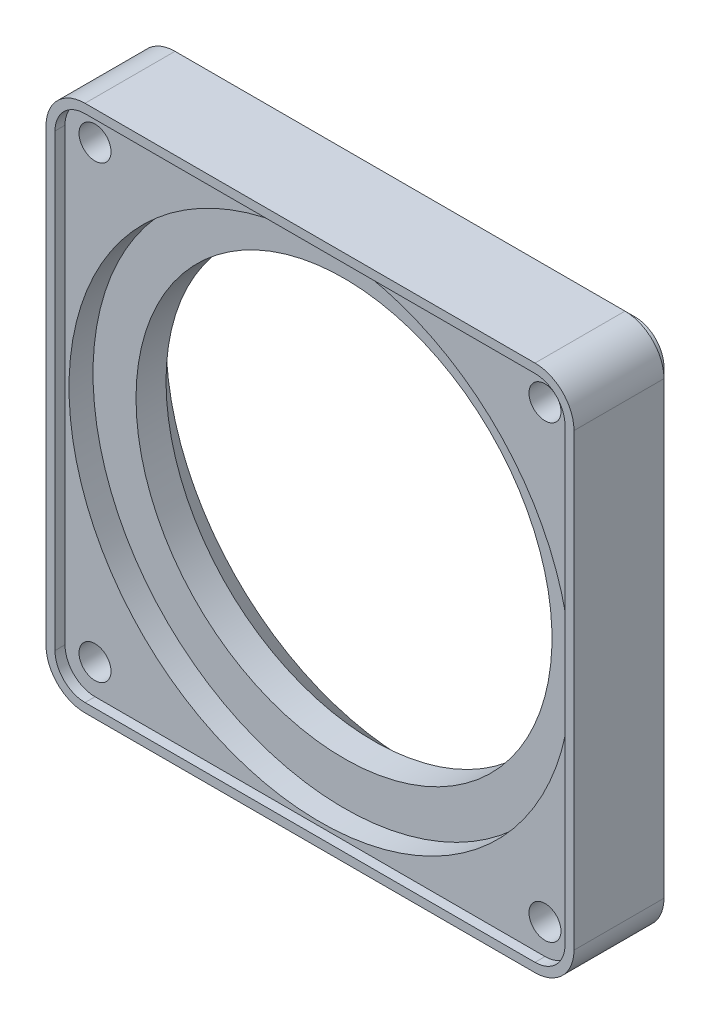
ISO-10303-21;
HEADER;
FILE_DESCRIPTION(('STEP AP214'),'2;1');
FILE_NAME('part.step','',(''),(''),'','','');
FILE_SCHEMA(('AUTOMOTIVE_DESIGN { 1 0 10303 214 1 1 1 1 }'));
ENDSEC;
DATA;
#1=APPLICATION_CONTEXT('core data for automotive mechanical design processes');
#2=APPLICATION_PROTOCOL_DEFINITION('international standard','automotive_design',2000,#1);
#3=PRODUCT_CONTEXT('',#1,'mechanical');
#4=PRODUCT('Part','Part','',(#3));
#5=PRODUCT_RELATED_PRODUCT_CATEGORY('part','',(#4));
#6=PRODUCT_DEFINITION_FORMATION('','',#4);
#7=PRODUCT_DEFINITION_CONTEXT('part definition',#1,'design');
#8=PRODUCT_DEFINITION('design','',#6,#7);
#9=PRODUCT_DEFINITION_SHAPE('','',#8);
#10=(LENGTH_UNIT() NAMED_UNIT(*) SI_UNIT(.MILLI.,.METRE.));
#11=(NAMED_UNIT(*) PLANE_ANGLE_UNIT() SI_UNIT($,.RADIAN.));
#12=(NAMED_UNIT(*) SI_UNIT($,.STERADIAN.) SOLID_ANGLE_UNIT());
#13=UNCERTAINTY_MEASURE_WITH_UNIT(LENGTH_MEASURE(1.E-05),#10,'distance_accuracy_value','');
#14=(GEOMETRIC_REPRESENTATION_CONTEXT(3) GLOBAL_UNCERTAINTY_ASSIGNED_CONTEXT((#13)) GLOBAL_UNIT_ASSIGNED_CONTEXT((#10,
#11,#12)) REPRESENTATION_CONTEXT('',''));
#15=CARTESIAN_POINT('',(0.,0.,0.));
#16=DIRECTION('',(0.,0.,1.));
#17=DIRECTION('',(1.,0.,0.));
#18=AXIS2_PLACEMENT_3D('',#15,#16,#17);
#19=CARTESIAN_POINT('',(-13.2,-13.2,-6.46999999999999));
#20=DIRECTION('',(0.,0.,1.));
#21=DIRECTION('',(1.,0.,0.));
#22=AXIS2_PLACEMENT_3D('',#19,#20,#21);
#23=PLANE('',#22);
#24=CARTESIAN_POINT('',(11.25,-11.25,-6.46999999999999));
#25=DIRECTION('',(0.,0.,1.));
#26=DIRECTION('',(1.,0.,0.));
#27=AXIS2_PLACEMENT_3D('',#24,#25,#26);
#28=CIRCLE('',#27,1.5);
#29=CARTESIAN_POINT('',(12.75,-11.25,-6.46999999999999));
#30=VERTEX_POINT('',#29);
#31=CARTESIAN_POINT('',(11.25,-12.75,-6.46999999999999));
#32=VERTEX_POINT('',#31);
#33=EDGE_CURVE('E210',#30,#32,#28,.F.);
#34=ORIENTED_EDGE('',*,*,#33,.T.);
#35=DIRECTION('',(1.,0.,0.));
#36=VECTOR('',#35,1.);
#37=CARTESIAN_POINT('',(11.25,-12.75,-6.46999999999999));
#38=LINE('',#37,#36);
#39=CARTESIAN_POINT('',(-11.25,-12.75,-6.46999999999999));
#40=VERTEX_POINT('',#39);
#41=EDGE_CURVE('E207',#40,#32,#38,.T.);
#42=ORIENTED_EDGE('',*,*,#41,.F.);
#43=CARTESIAN_POINT('',(-11.25,-11.25,-6.46999999999999));
#44=DIRECTION('',(0.,0.,1.));
#45=DIRECTION('',(1.,0.,0.));
#46=AXIS2_PLACEMENT_3D('',#43,#44,#45);
#47=CIRCLE('',#46,1.5);
#48=CARTESIAN_POINT('',(-12.75,-11.25,-6.46999999999999));
#49=VERTEX_POINT('',#48);
#50=EDGE_CURVE('E197',#40,#49,#47,.F.);
#51=ORIENTED_EDGE('',*,*,#50,.T.);
#52=DIRECTION('',(0.,1.,0.));
#53=VECTOR('',#52,1.);
#54=CARTESIAN_POINT('',(-12.75,-11.25,-6.46999999999999));
#55=LINE('',#54,#53);
#56=CARTESIAN_POINT('',(-12.75,11.25,-6.46999999999999));
#57=VERTEX_POINT('',#56);
#58=EDGE_CURVE('E187',#57,#49,#55,.F.);
#59=ORIENTED_EDGE('',*,*,#58,.F.);
#60=CARTESIAN_POINT('',(-11.25,11.25,-6.46999999999999));
#61=DIRECTION('',(0.,0.,1.));
#62=DIRECTION('',(1.,0.,0.));
#63=AXIS2_PLACEMENT_3D('',#60,#61,#62);
#64=CIRCLE('',#63,1.5);
#65=CARTESIAN_POINT('',(-11.25,12.75,-6.46999999999999));
#66=VERTEX_POINT('',#65);
#67=EDGE_CURVE('E20',#57,#66,#64,.F.);
#68=ORIENTED_EDGE('',*,*,#67,.T.);
#69=DIRECTION('',(1.,0.,0.));
#70=VECTOR('',#69,1.);
#71=CARTESIAN_POINT('',(-11.25,12.75,-6.46999999999999));
#72=LINE('',#71,#70);
#73=CARTESIAN_POINT('',(11.25,12.75,-6.46999999999999));
#74=VERTEX_POINT('',#73);
#75=EDGE_CURVE('E184',#74,#66,#72,.F.);
#76=ORIENTED_EDGE('',*,*,#75,.F.);
#77=CARTESIAN_POINT('',(11.25,11.25,-6.46999999999999));
#78=DIRECTION('',(0.,0.,1.));
#79=DIRECTION('',(1.,0.,0.));
#80=AXIS2_PLACEMENT_3D('',#77,#78,#79);
#81=CIRCLE('',#80,1.5);
#82=CARTESIAN_POINT('',(12.75,11.25,-6.46999999999999));
#83=VERTEX_POINT('',#82);
#84=EDGE_CURVE('E214',#74,#83,#81,.F.);
#85=ORIENTED_EDGE('',*,*,#84,.T.);
#86=DIRECTION('',(0.,1.,0.));
#87=VECTOR('',#86,1.);
#88=CARTESIAN_POINT('',(12.75,11.25,-6.46999999999999));
#89=LINE('',#88,#87);
#90=EDGE_CURVE('E211',#30,#83,#89,.T.);
#91=ORIENTED_EDGE('',*,*,#90,.F.);
#92=EDGE_LOOP('',(#34,#42,#51,#59,#68,#76,#85,#91));
#93=FACE_BOUND('',#92,.T.);
#94=DIRECTION('',(1.,0.,0.));
#95=VECTOR('',#94,1.);
#96=CARTESIAN_POINT('',(13.2,13.2,-6.46999999999999));
#97=LINE('',#96,#95);
#98=CARTESIAN_POINT('',(11.25,13.2,-6.46999999999999));
#99=VERTEX_POINT('',#98);
#100=CARTESIAN_POINT('',(-11.25,13.2,-6.46999999999999));
#101=VERTEX_POINT('',#100);
#102=EDGE_CURVE('E205',#99,#101,#97,.F.);
#103=ORIENTED_EDGE('',*,*,#102,.T.);
#104=CARTESIAN_POINT('',(-11.25,11.25,-6.46999999999999));
#105=DIRECTION('',(0.,0.,-1.));
#106=DIRECTION('',(-1.,0.,0.));
#107=AXIS2_PLACEMENT_3D('',#104,#105,#106);
#108=CIRCLE('',#107,1.95);
#109=CARTESIAN_POINT('',(-13.2,11.25,-6.46999999999999));
#110=VERTEX_POINT('',#109);
#111=EDGE_CURVE('E319',#110,#101,#108,.T.);
#112=ORIENTED_EDGE('',*,*,#111,.F.);
#113=DIRECTION('',(0.,1.,0.));
#114=VECTOR('',#113,1.);
#115=CARTESIAN_POINT('',(-13.2,13.2,-6.46999999999999));
#116=LINE('',#115,#114);
#117=CARTESIAN_POINT('',(-13.2,-11.25,-6.46999999999999));
#118=VERTEX_POINT('',#117);
#119=EDGE_CURVE('E347',#110,#118,#116,.F.);
#120=ORIENTED_EDGE('',*,*,#119,.T.);
#121=CARTESIAN_POINT('',(-11.25,-11.25,-6.46999999999999));
#122=DIRECTION('',(0.,0.,-1.));
#123=DIRECTION('',(-1.,0.,0.));
#124=AXIS2_PLACEMENT_3D('',#121,#122,#123);
#125=CIRCLE('',#124,1.95);
#126=CARTESIAN_POINT('',(-11.25,-13.2,-6.46999999999999));
#127=VERTEX_POINT('',#126);
#128=EDGE_CURVE('E315',#127,#118,#125,.T.);
#129=ORIENTED_EDGE('',*,*,#128,.F.);
#130=DIRECTION('',(1.,0.,0.));
#131=VECTOR('',#130,1.);
#132=CARTESIAN_POINT('',(-13.2,-13.2,-6.46999999999999));
#133=LINE('',#132,#131);
#134=CARTESIAN_POINT('',(11.25,-13.2,-6.46999999999999));
#135=VERTEX_POINT('',#134);
#136=EDGE_CURVE('E342',#127,#135,#133,.T.);
#137=ORIENTED_EDGE('',*,*,#136,.T.);
#138=CARTESIAN_POINT('',(11.25,-11.25,-6.46999999999999));
#139=DIRECTION('',(0.,0.,-1.));
#140=DIRECTION('',(-1.,0.,0.));
#141=AXIS2_PLACEMENT_3D('',#138,#139,#140);
#142=CIRCLE('',#141,1.95);
#143=CARTESIAN_POINT('',(13.2,-11.25,-6.46999999999999));
#144=VERTEX_POINT('',#143);
#145=EDGE_CURVE('E312',#144,#135,#142,.T.);
#146=ORIENTED_EDGE('',*,*,#145,.F.);
#147=DIRECTION('',(0.,1.,0.));
#148=VECTOR('',#147,1.);
#149=CARTESIAN_POINT('',(13.2,-13.2,-6.46999999999999));
#150=LINE('',#149,#148);
#151=CARTESIAN_POINT('',(13.2,11.25,-6.46999999999999));
#152=VERTEX_POINT('',#151);
#153=EDGE_CURVE('E326',#144,#152,#150,.T.);
#154=ORIENTED_EDGE('',*,*,#153,.T.);
#155=CARTESIAN_POINT('',(11.25,11.25,-6.46999999999999));
#156=DIRECTION('',(0.,0.,-1.));
#157=DIRECTION('',(-1.,0.,0.));
#158=AXIS2_PLACEMENT_3D('',#155,#156,#157);
#159=CIRCLE('',#158,1.95);
#160=EDGE_CURVE('E323',#99,#152,#159,.T.);
#161=ORIENTED_EDGE('',*,*,#160,.F.);
#162=EDGE_LOOP('',(#103,#112,#120,#129,#137,#146,#154,#161));
#163=FACE_BOUND('',#162,.T.);
#164=ADVANCED_FACE('F17',(#93,#163),#23,.T.);
#165=CARTESIAN_POINT('',(0.,0.,-8.16999999999999));
#166=DIRECTION('',(0.,0.,1.));
#167=DIRECTION('',(1.,0.,0.));
#168=AXIS2_PLACEMENT_3D('',#165,#166,#167);
#169=PLANE('',#168);
#170=CARTESIAN_POINT('',(0.,0.,-8.16999999999999));
#171=DIRECTION('',(0.,0.,-1.));
#172=DIRECTION('',(-1.,0.,0.));
#173=AXIS2_PLACEMENT_3D('',#170,#171,#172);
#174=CIRCLE('',#173,10.4);
#175=CARTESIAN_POINT('',(-10.4,0.,-8.16999999999999));
#176=VERTEX_POINT('',#175);
#177=EDGE_CURVE('E308',#176,#176,#174,.T.);
#178=ORIENTED_EDGE('',*,*,#177,.T.);
#179=EDGE_LOOP('',(#178));
#180=FACE_BOUND('',#179,.T.);
#181=CARTESIAN_POINT('',(0.,0.,-8.16999999999999));
#182=DIRECTION('',(0.,0.,1.));
#183=DIRECTION('',(1.,0.,0.));
#184=AXIS2_PLACEMENT_3D('',#181,#182,#183);
#185=CIRCLE('',#184,12.55);
#186=CARTESIAN_POINT('',(12.55,0.,-8.16999999999999));
#187=VERTEX_POINT('',#186);
#188=EDGE_CURVE('E191',#187,#187,#185,.T.);
#189=ORIENTED_EDGE('',*,*,#188,.T.);
#190=EDGE_LOOP('',(#189));
#191=FACE_BOUND('',#190,.T.);
#192=ADVANCED_FACE('F588',(#180,#191),#169,.T.);
#193=CARTESIAN_POINT('',(-11.25,11.25,-6.96999999999999));
#194=DIRECTION('',(0.,0.,1.));
#195=DIRECTION('',(1.,0.,0.));
#196=AXIS2_PLACEMENT_3D('',#193,#194,#195);
#197=CYLINDRICAL_SURFACE('',#196,1.5);
#198=DIRECTION('',(0.,0.,1.));
#199=VECTOR('',#198,1.);
#200=CARTESIAN_POINT('',(-12.75,11.25,-6.96999999999999));
#201=LINE('',#200,#199);
#202=CARTESIAN_POINT('',(-12.75,11.25,-6.96999999999999));
#203=VERTEX_POINT('',#202);
#204=EDGE_CURVE('E179',#203,#57,#201,.T.);
#205=ORIENTED_EDGE('',*,*,#204,.F.);
#206=CARTESIAN_POINT('',(-11.25,11.25,-6.96999999999999));
#207=DIRECTION('',(0.,0.,1.));
#208=DIRECTION('',(1.,0.,0.));
#209=AXIS2_PLACEMENT_3D('',#206,#207,#208);
#210=CIRCLE('',#209,1.5);
#211=CARTESIAN_POINT('',(-11.25,12.75,-6.96999999999999));
#212=VERTEX_POINT('',#211);
#213=EDGE_CURVE('E306',#203,#212,#210,.F.);
#214=ORIENTED_EDGE('',*,*,#213,.T.);
#215=DIRECTION('',(0.,0.,1.));
#216=VECTOR('',#215,1.);
#217=CARTESIAN_POINT('',(-11.25,12.75,-6.96999999999999));
#218=LINE('',#217,#216);
#219=EDGE_CURVE('E181',#66,#212,#218,.F.);
#220=ORIENTED_EDGE('',*,*,#219,.F.);
#221=ORIENTED_EDGE('',*,*,#67,.F.);
#222=EDGE_LOOP('',(#205,#214,#220,#221));
#223=FACE_BOUND('',#222,.T.);
#224=ADVANCED_FACE('F177',(#223),#197,.F.);
#225=CARTESIAN_POINT('',(-11.25,12.75,-6.96999999999999));
#226=DIRECTION('',(0.,-1.,0.));
#227=DIRECTION('',(1.,0.,0.));
#228=AXIS2_PLACEMENT_3D('',#225,#226,#227);
#229=PLANE('',#228);
#230=DIRECTION('',(-1.,0.,0.));
#231=VECTOR('',#230,1.);
#232=CARTESIAN_POINT('',(-11.25,12.75,-6.96999999999999));
#233=LINE('',#232,#231);
#234=CARTESIAN_POINT('',(11.25,12.75,-6.96999999999999));
#235=VERTEX_POINT('',#234);
#236=EDGE_CURVE('E305',#212,#235,#233,.F.);
#237=ORIENTED_EDGE('',*,*,#236,.T.);
#238=DIRECTION('',(0.,0.,1.));
#239=VECTOR('',#238,1.);
#240=CARTESIAN_POINT('',(11.25,12.75,-6.96999999999999));
#241=LINE('',#240,#239);
#242=EDGE_CURVE('E331',#235,#74,#241,.T.);
#243=ORIENTED_EDGE('',*,*,#242,.T.);
#244=ORIENTED_EDGE('',*,*,#75,.T.);
#245=ORIENTED_EDGE('',*,*,#219,.T.);
#246=EDGE_LOOP('',(#237,#243,#244,#245));
#247=FACE_BOUND('',#246,.T.);
#248=ADVANCED_FACE('F382',(#247),#229,.T.);
#249=CARTESIAN_POINT('',(11.25,11.25,-6.96999999999999));
#250=DIRECTION('',(0.,0.,1.));
#251=DIRECTION('',(1.,0.,0.));
#252=AXIS2_PLACEMENT_3D('',#249,#250,#251);
#253=CYLINDRICAL_SURFACE('',#252,1.5);
#254=ORIENTED_EDGE('',*,*,#242,.F.);
#255=CARTESIAN_POINT('',(11.25,11.25,-6.96999999999999));
#256=DIRECTION('',(0.,0.,1.));
#257=DIRECTION('',(1.,0.,0.));
#258=AXIS2_PLACEMENT_3D('',#255,#256,#257);
#259=CIRCLE('',#258,1.5);
#260=CARTESIAN_POINT('',(12.75,11.25,-6.96999999999999));
#261=VERTEX_POINT('',#260);
#262=EDGE_CURVE('E302',#235,#261,#259,.F.);
#263=ORIENTED_EDGE('',*,*,#262,.T.);
#264=DIRECTION('',(0.,0.,1.));
#265=VECTOR('',#264,1.);
#266=CARTESIAN_POINT('',(12.75,11.25,-6.96999999999999));
#267=LINE('',#266,#265);
#268=EDGE_CURVE('E213',#83,#261,#267,.F.);
#269=ORIENTED_EDGE('',*,*,#268,.F.);
#270=ORIENTED_EDGE('',*,*,#84,.F.);
#271=EDGE_LOOP('',(#254,#263,#269,#270));
#272=FACE_BOUND('',#271,.T.);
#273=ADVANCED_FACE('F380',(#272),#253,.F.);
#274=CARTESIAN_POINT('',(12.75,11.25,-6.96999999999999));
#275=DIRECTION('',(-1.,0.,0.));
#276=DIRECTION('',(0.,0.,1.));
#277=AXIS2_PLACEMENT_3D('',#274,#275,#276);
#278=PLANE('',#277);
#279=DIRECTION('',(0.,1.,0.));
#280=VECTOR('',#279,1.);
#281=CARTESIAN_POINT('',(12.75,11.25,-6.96999999999999));
#282=LINE('',#281,#280);
#283=CARTESIAN_POINT('',(12.75,-11.25,-6.96999999999999));
#284=VERTEX_POINT('',#283);
#285=EDGE_CURVE('E301',#261,#284,#282,.F.);
#286=ORIENTED_EDGE('',*,*,#285,.T.);
#287=DIRECTION('',(0.,0.,1.));
#288=VECTOR('',#287,1.);
#289=CARTESIAN_POINT('',(12.75,-11.25,-6.96999999999999));
#290=LINE('',#289,#288);
#291=EDGE_CURVE('E329',#284,#30,#290,.T.);
#292=ORIENTED_EDGE('',*,*,#291,.T.);
#293=ORIENTED_EDGE('',*,*,#90,.T.);
#294=ORIENTED_EDGE('',*,*,#268,.T.);
#295=EDGE_LOOP('',(#286,#292,#293,#294));
#296=FACE_BOUND('',#295,.T.);
#297=ADVANCED_FACE('F369',(#296),#278,.T.);
#298=CARTESIAN_POINT('',(11.25,-11.25,-6.96999999999999));
#299=DIRECTION('',(0.,0.,1.));
#300=DIRECTION('',(1.,0.,0.));
#301=AXIS2_PLACEMENT_3D('',#298,#299,#300);
#302=CYLINDRICAL_SURFACE('',#301,1.5);
#303=ORIENTED_EDGE('',*,*,#291,.F.);
#304=CARTESIAN_POINT('',(11.25,-11.25,-6.96999999999999));
#305=DIRECTION('',(0.,0.,1.));
#306=DIRECTION('',(1.,0.,0.));
#307=AXIS2_PLACEMENT_3D('',#304,#305,#306);
#308=CIRCLE('',#307,1.5);
#309=CARTESIAN_POINT('',(11.25,-12.75,-6.96999999999999));
#310=VERTEX_POINT('',#309);
#311=EDGE_CURVE('E298',#284,#310,#308,.F.);
#312=ORIENTED_EDGE('',*,*,#311,.T.);
#313=DIRECTION('',(0.,0.,1.));
#314=VECTOR('',#313,1.);
#315=CARTESIAN_POINT('',(11.25,-12.75,-6.96999999999999));
#316=LINE('',#315,#314);
#317=EDGE_CURVE('E209',#32,#310,#316,.F.);
#318=ORIENTED_EDGE('',*,*,#317,.F.);
#319=ORIENTED_EDGE('',*,*,#33,.F.);
#320=EDGE_LOOP('',(#303,#312,#318,#319));
#321=FACE_BOUND('',#320,.T.);
#322=ADVANCED_FACE('F389',(#321),#302,.F.);
#323=CARTESIAN_POINT('',(11.25,-12.75,-6.96999999999999));
#324=DIRECTION('',(0.,1.,0.));
#325=DIRECTION('',(0.,0.,1.));
#326=AXIS2_PLACEMENT_3D('',#323,#324,#325);
#327=PLANE('',#326);
#328=DIRECTION('',(-1.,0.,0.));
#329=VECTOR('',#328,1.);
#330=CARTESIAN_POINT('',(-11.25,-12.75,-6.96999999999999));
#331=LINE('',#330,#329);
#332=CARTESIAN_POINT('',(-11.25,-12.75,-6.96999999999999));
#333=VERTEX_POINT('',#332);
#334=EDGE_CURVE('E297',#310,#333,#331,.T.);
#335=ORIENTED_EDGE('',*,*,#334,.T.);
#336=DIRECTION('',(0.,0.,1.));
#337=VECTOR('',#336,1.);
#338=CARTESIAN_POINT('',(-11.25,-12.75,-6.96999999999999));
#339=LINE('',#338,#337);
#340=EDGE_CURVE('E201',#333,#40,#339,.T.);
#341=ORIENTED_EDGE('',*,*,#340,.T.);
#342=ORIENTED_EDGE('',*,*,#41,.T.);
#343=ORIENTED_EDGE('',*,*,#317,.T.);
#344=EDGE_LOOP('',(#335,#341,#342,#343));
#345=FACE_BOUND('',#344,.T.);
#346=ADVANCED_FACE('F503',(#345),#327,.T.);
#347=CARTESIAN_POINT('',(-11.25,-11.25,-6.96999999999999));
#348=DIRECTION('',(0.,0.,1.));
#349=DIRECTION('',(1.,0.,0.));
#350=AXIS2_PLACEMENT_3D('',#347,#348,#349);
#351=CYLINDRICAL_SURFACE('',#350,1.5);
#352=ORIENTED_EDGE('',*,*,#340,.F.);
#353=CARTESIAN_POINT('',(-11.25,-11.25,-6.96999999999999));
#354=DIRECTION('',(0.,0.,1.));
#355=DIRECTION('',(1.,0.,0.));
#356=AXIS2_PLACEMENT_3D('',#353,#354,#355);
#357=CIRCLE('',#356,1.5);
#358=CARTESIAN_POINT('',(-12.75,-11.25,-6.96999999999999));
#359=VERTEX_POINT('',#358);
#360=EDGE_CURVE('E294',#333,#359,#357,.F.);
#361=ORIENTED_EDGE('',*,*,#360,.T.);
#362=DIRECTION('',(0.,0.,1.));
#363=VECTOR('',#362,1.);
#364=CARTESIAN_POINT('',(-12.75,-11.25,-6.96999999999999));
#365=LINE('',#364,#363);
#366=EDGE_CURVE('E192',#49,#359,#365,.F.);
#367=ORIENTED_EDGE('',*,*,#366,.F.);
#368=ORIENTED_EDGE('',*,*,#50,.F.);
#369=EDGE_LOOP('',(#352,#361,#367,#368));
#370=FACE_BOUND('',#369,.T.);
#371=ADVANCED_FACE('F500',(#370),#351,.F.);
#372=CARTESIAN_POINT('',(-12.75,-11.25,-6.96999999999999));
#373=DIRECTION('',(1.,0.,0.));
#374=DIRECTION('',(0.,1.,0.));
#375=AXIS2_PLACEMENT_3D('',#372,#373,#374);
#376=PLANE('',#375);
#377=DIRECTION('',(0.,1.,0.));
#378=VECTOR('',#377,1.);
#379=CARTESIAN_POINT('',(-12.75,11.25,-6.96999999999999));
#380=LINE('',#379,#378);
#381=EDGE_CURVE('E190',#359,#203,#380,.T.);
#382=ORIENTED_EDGE('',*,*,#381,.T.);
#383=ORIENTED_EDGE('',*,*,#204,.T.);
#384=ORIENTED_EDGE('',*,*,#58,.T.);
#385=ORIENTED_EDGE('',*,*,#366,.T.);
#386=EDGE_LOOP('',(#382,#383,#384,#385));
#387=FACE_BOUND('',#386,.T.);
#388=ADVANCED_FACE('F186',(#387),#376,.T.);
#389=CARTESIAN_POINT('',(0.,0.,-8.16999999999999));
#390=DIRECTION('',(0.,0.,1.));
#391=DIRECTION('',(1.,0.,0.));
#392=AXIS2_PLACEMENT_3D('',#389,#390,#391);
#393=CYLINDRICAL_SURFACE('',#392,12.55);
#394=ORIENTED_EDGE('',*,*,#188,.F.);
#395=EDGE_LOOP('',(#394));
#396=FACE_BOUND('',#395,.T.);
#397=CARTESIAN_POINT('',(0.,0.,-6.96999999999999));
#398=DIRECTION('',(0.,0.,1.));
#399=DIRECTION('',(1.,0.,0.));
#400=AXIS2_PLACEMENT_3D('',#397,#398,#399);
#401=CIRCLE('',#400,12.55);
#402=CARTESIAN_POINT('',(12.55,0.,-6.96999999999999));
#403=VERTEX_POINT('',#402);
#404=EDGE_CURVE('E291',#403,#403,#401,.T.);
#405=ORIENTED_EDGE('',*,*,#404,.T.);
#406=EDGE_LOOP('',(#405));
#407=FACE_BOUND('',#406,.T.);
#408=ADVANCED_FACE('F493',(#396,#407),#393,.F.);
#409=CARTESIAN_POINT('',(13.2,-13.2,-6.46999999999999));
#410=DIRECTION('',(-1.,0.,0.));
#411=DIRECTION('',(0.,0.,1.));
#412=AXIS2_PLACEMENT_3D('',#409,#410,#411);
#413=PLANE('',#412);
#414=DIRECTION('',(0.,1.,0.));
#415=VECTOR('',#414,1.);
#416=CARTESIAN_POINT('',(13.2,-11.25,-10.97));
#417=LINE('',#416,#415);
#418=CARTESIAN_POINT('',(13.2,-11.25,-10.97));
#419=VERTEX_POINT('',#418);
#420=CARTESIAN_POINT('',(13.2,11.25,-10.97));
#421=VERTEX_POINT('',#420);
#422=EDGE_CURVE('E290',#419,#421,#417,.T.);
#423=ORIENTED_EDGE('',*,*,#422,.T.);
#424=DIRECTION('',(0.,0.,-1.));
#425=VECTOR('',#424,1.);
#426=CARTESIAN_POINT('',(13.2,11.25,-6.46999999999999));
#427=LINE('',#426,#425);
#428=EDGE_CURVE('E325',#152,#421,#427,.T.);
#429=ORIENTED_EDGE('',*,*,#428,.F.);
#430=ORIENTED_EDGE('',*,*,#153,.F.);
#431=DIRECTION('',(0.,0.,-1.));
#432=VECTOR('',#431,1.);
#433=CARTESIAN_POINT('',(13.2,-11.25,-6.46999999999999));
#434=LINE('',#433,#432);
#435=EDGE_CURVE('E314',#419,#144,#434,.F.);
#436=ORIENTED_EDGE('',*,*,#435,.F.);
#437=EDGE_LOOP('',(#423,#429,#430,#436));
#438=FACE_BOUND('',#437,.T.);
#439=ADVANCED_FACE('F489',(#438),#413,.F.);
#440=CARTESIAN_POINT('',(11.25,11.25,-6.46999999999999));
#441=DIRECTION('',(0.,0.,-1.));
#442=DIRECTION('',(-1.,0.,0.));
#443=AXIS2_PLACEMENT_3D('',#440,#441,#442);
#444=CYLINDRICAL_SURFACE('',#443,1.95);
#445=ORIENTED_EDGE('',*,*,#160,.T.);
#446=ORIENTED_EDGE('',*,*,#428,.T.);
#447=CARTESIAN_POINT('',(11.25,11.25,-10.97));
#448=DIRECTION('',(0.,0.,-1.));
#449=DIRECTION('',(-1.,0.,0.));
#450=AXIS2_PLACEMENT_3D('',#447,#448,#449);
#451=CIRCLE('',#450,1.95);
#452=CARTESIAN_POINT('',(11.25,13.2,-10.97));
#453=VERTEX_POINT('',#452);
#454=EDGE_CURVE('E287',#421,#453,#451,.F.);
#455=ORIENTED_EDGE('',*,*,#454,.T.);
#456=DIRECTION('',(0.,0.,1.));
#457=VECTOR('',#456,1.);
#458=CARTESIAN_POINT('',(11.25,13.2,-6.46999999999999));
#459=LINE('',#458,#457);
#460=EDGE_CURVE('E322',#453,#99,#459,.T.);
#461=ORIENTED_EDGE('',*,*,#460,.T.);
#462=EDGE_LOOP('',(#445,#446,#455,#461));
#463=FACE_BOUND('',#462,.T.);
#464=ADVANCED_FACE('F485',(#463),#444,.T.);
#465=CARTESIAN_POINT('',(13.2,13.2,-6.46999999999999));
#466=DIRECTION('',(0.,-1.,0.));
#467=DIRECTION('',(1.,0.,0.));
#468=AXIS2_PLACEMENT_3D('',#465,#466,#467);
#469=PLANE('',#468);
#470=DIRECTION('',(1.,0.,0.));
#471=VECTOR('',#470,1.);
#472=CARTESIAN_POINT('',(11.25,13.2,-10.97));
#473=LINE('',#472,#471);
#474=CARTESIAN_POINT('',(-11.25,13.2,-10.97));
#475=VERTEX_POINT('',#474);
#476=EDGE_CURVE('E286',#453,#475,#473,.F.);
#477=ORIENTED_EDGE('',*,*,#476,.T.);
#478=DIRECTION('',(0.,0.,-1.));
#479=VECTOR('',#478,1.);
#480=CARTESIAN_POINT('',(-11.25,13.2,-6.46999999999999));
#481=LINE('',#480,#479);
#482=EDGE_CURVE('E321',#101,#475,#481,.T.);
#483=ORIENTED_EDGE('',*,*,#482,.F.);
#484=ORIENTED_EDGE('',*,*,#102,.F.);
#485=ORIENTED_EDGE('',*,*,#460,.F.);
#486=EDGE_LOOP('',(#477,#483,#484,#485));
#487=FACE_BOUND('',#486,.T.);
#488=ADVANCED_FACE('F482',(#487),#469,.F.);
#489=CARTESIAN_POINT('',(-11.25,11.25,-6.46999999999999));
#490=DIRECTION('',(0.,0.,-1.));
#491=DIRECTION('',(-1.,0.,0.));
#492=AXIS2_PLACEMENT_3D('',#489,#490,#491);
#493=CYLINDRICAL_SURFACE('',#492,1.95);
#494=ORIENTED_EDGE('',*,*,#111,.T.);
#495=ORIENTED_EDGE('',*,*,#482,.T.);
#496=CARTESIAN_POINT('',(-11.25,11.25,-10.97));
#497=DIRECTION('',(0.,0.,-1.));
#498=DIRECTION('',(-1.,0.,0.));
#499=AXIS2_PLACEMENT_3D('',#496,#497,#498);
#500=CIRCLE('',#499,1.95);
#501=CARTESIAN_POINT('',(-13.2,11.25,-10.97));
#502=VERTEX_POINT('',#501);
#503=EDGE_CURVE('E283',#475,#502,#500,.F.);
#504=ORIENTED_EDGE('',*,*,#503,.T.);
#505=DIRECTION('',(0.,0.,1.));
#506=VECTOR('',#505,1.);
#507=CARTESIAN_POINT('',(-13.2,11.25,-6.46999999999999));
#508=LINE('',#507,#506);
#509=EDGE_CURVE('E318',#502,#110,#508,.T.);
#510=ORIENTED_EDGE('',*,*,#509,.T.);
#511=EDGE_LOOP('',(#494,#495,#504,#510));
#512=FACE_BOUND('',#511,.T.);
#513=ADVANCED_FACE('F478',(#512),#493,.T.);
#514=CARTESIAN_POINT('',(-13.2,13.2,-6.46999999999999));
#515=DIRECTION('',(1.,0.,0.));
#516=DIRECTION('',(0.,1.,0.));
#517=AXIS2_PLACEMENT_3D('',#514,#515,#516);
#518=PLANE('',#517);
#519=DIRECTION('',(0.,1.,0.));
#520=VECTOR('',#519,1.);
#521=CARTESIAN_POINT('',(-13.2,-11.25,-10.97));
#522=LINE('',#521,#520);
#523=CARTESIAN_POINT('',(-13.2,-11.25,-10.97));
#524=VERTEX_POINT('',#523);
#525=EDGE_CURVE('E282',#502,#524,#522,.F.);
#526=ORIENTED_EDGE('',*,*,#525,.T.);
#527=DIRECTION('',(0.,0.,-1.));
#528=VECTOR('',#527,1.);
#529=CARTESIAN_POINT('',(-13.2,-11.25,-6.46999999999999));
#530=LINE('',#529,#528);
#531=EDGE_CURVE('E317',#118,#524,#530,.T.);
#532=ORIENTED_EDGE('',*,*,#531,.F.);
#533=ORIENTED_EDGE('',*,*,#119,.F.);
#534=ORIENTED_EDGE('',*,*,#509,.F.);
#535=EDGE_LOOP('',(#526,#532,#533,#534));
#536=FACE_BOUND('',#535,.T.);
#537=ADVANCED_FACE('F474',(#536),#518,.F.);
#538=CARTESIAN_POINT('',(-11.25,-11.25,-6.46999999999999));
#539=DIRECTION('',(0.,0.,-1.));
#540=DIRECTION('',(-1.,0.,0.));
#541=AXIS2_PLACEMENT_3D('',#538,#539,#540);
#542=CYLINDRICAL_SURFACE('',#541,1.95);
#543=ORIENTED_EDGE('',*,*,#128,.T.);
#544=ORIENTED_EDGE('',*,*,#531,.T.);
#545=CARTESIAN_POINT('',(-11.25,-11.25,-10.97));
#546=DIRECTION('',(0.,0.,-1.));
#547=DIRECTION('',(-1.,0.,0.));
#548=AXIS2_PLACEMENT_3D('',#545,#546,#547);
#549=CIRCLE('',#548,1.95);
#550=CARTESIAN_POINT('',(-11.25,-13.2,-10.97));
#551=VERTEX_POINT('',#550);
#552=EDGE_CURVE('E279',#524,#551,#549,.F.);
#553=ORIENTED_EDGE('',*,*,#552,.T.);
#554=DIRECTION('',(0.,0.,1.));
#555=VECTOR('',#554,1.);
#556=CARTESIAN_POINT('',(-11.25,-13.2,-6.46999999999999));
#557=LINE('',#556,#555);
#558=EDGE_CURVE('E345',#551,#127,#557,.T.);
#559=ORIENTED_EDGE('',*,*,#558,.T.);
#560=EDGE_LOOP('',(#543,#544,#553,#559));
#561=FACE_BOUND('',#560,.T.);
#562=ADVANCED_FACE('F470',(#561),#542,.T.);
#563=CARTESIAN_POINT('',(-13.2,-13.2,-6.46999999999999));
#564=DIRECTION('',(0.,1.,0.));
#565=DIRECTION('',(0.,0.,1.));
#566=AXIS2_PLACEMENT_3D('',#563,#564,#565);
#567=PLANE('',#566);
#568=DIRECTION('',(1.,0.,0.));
#569=VECTOR('',#568,1.);
#570=CARTESIAN_POINT('',(11.25,-13.2,-10.97));
#571=LINE('',#570,#569);
#572=CARTESIAN_POINT('',(11.25,-13.2,-10.97));
#573=VERTEX_POINT('',#572);
#574=EDGE_CURVE('E278',#551,#573,#571,.T.);
#575=ORIENTED_EDGE('',*,*,#574,.T.);
#576=DIRECTION('',(0.,0.,-1.));
#577=VECTOR('',#576,1.);
#578=CARTESIAN_POINT('',(11.25,-13.2,-6.46999999999999));
#579=LINE('',#578,#577);
#580=EDGE_CURVE('E311',#135,#573,#579,.T.);
#581=ORIENTED_EDGE('',*,*,#580,.F.);
#582=ORIENTED_EDGE('',*,*,#136,.F.);
#583=ORIENTED_EDGE('',*,*,#558,.F.);
#584=EDGE_LOOP('',(#575,#581,#582,#583));
#585=FACE_BOUND('',#584,.T.);
#586=ADVANCED_FACE('F466',(#585),#567,.F.);
#587=CARTESIAN_POINT('',(11.25,-11.25,-6.46999999999999));
#588=DIRECTION('',(0.,0.,-1.));
#589=DIRECTION('',(-1.,0.,0.));
#590=AXIS2_PLACEMENT_3D('',#587,#588,#589);
#591=CYLINDRICAL_SURFACE('',#590,1.95);
#592=ORIENTED_EDGE('',*,*,#145,.T.);
#593=ORIENTED_EDGE('',*,*,#580,.T.);
#594=CARTESIAN_POINT('',(11.25,-11.25,-10.97));
#595=DIRECTION('',(0.,0.,-1.));
#596=DIRECTION('',(-1.,0.,0.));
#597=AXIS2_PLACEMENT_3D('',#594,#595,#596);
#598=CIRCLE('',#597,1.95);
#599=EDGE_CURVE('E275',#573,#419,#598,.F.);
#600=ORIENTED_EDGE('',*,*,#599,.T.);
#601=ORIENTED_EDGE('',*,*,#435,.T.);
#602=EDGE_LOOP('',(#592,#593,#600,#601));
#603=FACE_BOUND('',#602,.T.);
#604=ADVANCED_FACE('F462',(#603),#591,.T.);
#605=CARTESIAN_POINT('',(0.,0.,38.03));
#606=DIRECTION('',(0.,0.,-1.));
#607=DIRECTION('',(-1.,0.,0.));
#608=AXIS2_PLACEMENT_3D('',#605,#606,#607);
#609=CYLINDRICAL_SURFACE('',#608,10.4);
#610=CARTESIAN_POINT('',(0.,0.,-9.66999999999999));
#611=DIRECTION('',(0.,0.,-1.));
#612=DIRECTION('',(-1.,0.,0.));
#613=AXIS2_PLACEMENT_3D('',#610,#611,#612);
#614=CIRCLE('',#613,10.4);
#615=CARTESIAN_POINT('',(-10.4,0.,-9.66999999999999));
#616=VERTEX_POINT('',#615);
#617=EDGE_CURVE('E274',#616,#616,#614,.T.);
#618=ORIENTED_EDGE('',*,*,#617,.T.);
#619=EDGE_LOOP('',(#618));
#620=FACE_BOUND('',#619,.T.);
#621=ORIENTED_EDGE('',*,*,#177,.F.);
#622=EDGE_LOOP('',(#621));
#623=FACE_BOUND('',#622,.T.);
#624=ADVANCED_FACE('F458',(#620,#623),#609,.F.);
#625=CARTESIAN_POINT('',(-11.25,11.25,-6.96999999999999));
#626=DIRECTION('',(0.,0.,-1.));
#627=DIRECTION('',(-1.,0.,0.));
#628=AXIS2_PLACEMENT_3D('',#625,#626,#627);
#629=PLANE('',#628);
#630=ORIENTED_EDGE('',*,*,#404,.F.);
#631=EDGE_LOOP('',(#630));
#632=FACE_BOUND('',#631,.T.);
#633=CARTESIAN_POINT('',(-11.25,-11.25,-6.96999999999999));
#634=DIRECTION('',(0.,0.,1.));
#635=DIRECTION('',(1.,0.,0.));
#636=AXIS2_PLACEMENT_3D('',#633,#634,#635);
#637=CIRCLE('',#636,0.799999999999999);
#638=CARTESIAN_POINT('',(-10.45,-11.25,-6.96999999999999));
#639=VERTEX_POINT('',#638);
#640=EDGE_CURVE('E265',#639,#639,#637,.F.);
#641=ORIENTED_EDGE('',*,*,#640,.T.);
#642=EDGE_LOOP('',(#641));
#643=FACE_BOUND('',#642,.T.);
#644=CARTESIAN_POINT('',(11.25,-11.25,-6.96999999999999));
#645=DIRECTION('',(0.,0.,1.));
#646=DIRECTION('',(1.,0.,0.));
#647=AXIS2_PLACEMENT_3D('',#644,#645,#646);
#648=CIRCLE('',#647,0.799999999999999);
#649=CARTESIAN_POINT('',(12.05,-11.25,-6.96999999999999));
#650=VERTEX_POINT('',#649);
#651=EDGE_CURVE('E262',#650,#650,#648,.F.);
#652=ORIENTED_EDGE('',*,*,#651,.T.);
#653=EDGE_LOOP('',(#652));
#654=FACE_BOUND('',#653,.T.);
#655=CARTESIAN_POINT('',(11.25,11.25,-6.96999999999999));
#656=DIRECTION('',(0.,0.,1.));
#657=DIRECTION('',(1.,0.,0.));
#658=AXIS2_PLACEMENT_3D('',#655,#656,#657);
#659=CIRCLE('',#658,0.799999999999999);
#660=CARTESIAN_POINT('',(12.05,11.25,-6.96999999999999));
#661=VERTEX_POINT('',#660);
#662=EDGE_CURVE('E271',#661,#661,#659,.F.);
#663=ORIENTED_EDGE('',*,*,#662,.T.);
#664=EDGE_LOOP('',(#663));
#665=FACE_BOUND('',#664,.T.);
#666=ORIENTED_EDGE('',*,*,#360,.F.);
#667=ORIENTED_EDGE('',*,*,#334,.F.);
#668=ORIENTED_EDGE('',*,*,#311,.F.);
#669=ORIENTED_EDGE('',*,*,#285,.F.);
#670=ORIENTED_EDGE('',*,*,#262,.F.);
#671=ORIENTED_EDGE('',*,*,#236,.F.);
#672=ORIENTED_EDGE('',*,*,#213,.F.);
#673=ORIENTED_EDGE('',*,*,#381,.F.);
#674=EDGE_LOOP('',(#666,#667,#668,#669,#670,#671,#672,#673));
#675=FACE_BOUND('',#674,.T.);
#676=CARTESIAN_POINT('',(-11.25,11.25,-6.96999999999999));
#677=DIRECTION('',(0.,0.,1.));
#678=DIRECTION('',(1.,0.,0.));
#679=AXIS2_PLACEMENT_3D('',#676,#677,#678);
#680=CIRCLE('',#679,0.799999999999999);
#681=CARTESIAN_POINT('',(-10.45,11.25,-6.96999999999999));
#682=VERTEX_POINT('',#681);
#683=EDGE_CURVE('E268',#682,#682,#680,.F.);
#684=ORIENTED_EDGE('',*,*,#683,.T.);
#685=EDGE_LOOP('',(#684));
#686=FACE_BOUND('',#685,.T.);
#687=ADVANCED_FACE('F375',(#632,#643,#654,#665,#675,#686),#629,.F.);
#688=CARTESIAN_POINT('',(11.25,-11.25,-10.97));
#689=DIRECTION('',(0.,0.,1.));
#690=DIRECTION('',(1.,0.,0.));
#691=AXIS2_PLACEMENT_3D('',#688,#689,#690);
#692=PLANE('',#691);
#693=CARTESIAN_POINT('',(-11.25,-11.25,-10.97));
#694=DIRECTION('',(0.,0.,-1.));
#695=DIRECTION('',(-1.,0.,0.));
#696=AXIS2_PLACEMENT_3D('',#693,#694,#695);
#697=CIRCLE('',#696,1.45);
#698=CARTESIAN_POINT('',(-11.25,-12.7,-10.97));
#699=VERTEX_POINT('',#698);
#700=CARTESIAN_POINT('',(-12.7,-11.25,-10.97));
#701=VERTEX_POINT('',#700);
#702=EDGE_CURVE('E259',#699,#701,#697,.T.);
#703=ORIENTED_EDGE('',*,*,#702,.F.);
#704=DIRECTION('',(1.,0.,0.));
#705=VECTOR('',#704,1.);
#706=CARTESIAN_POINT('',(-11.25,-12.7,-10.97));
#707=LINE('',#706,#705);
#708=CARTESIAN_POINT('',(11.25,-12.7,-10.97));
#709=VERTEX_POINT('',#708);
#710=EDGE_CURVE('E258',#699,#709,#707,.T.);
#711=ORIENTED_EDGE('',*,*,#710,.T.);
#712=CARTESIAN_POINT('',(11.25,-11.25,-10.97));
#713=DIRECTION('',(0.,0.,-1.));
#714=DIRECTION('',(-1.,0.,0.));
#715=AXIS2_PLACEMENT_3D('',#712,#713,#714);
#716=CIRCLE('',#715,1.45);
#717=CARTESIAN_POINT('',(12.7,-11.25,-10.97));
#718=VERTEX_POINT('',#717);
#719=EDGE_CURVE('E255',#718,#709,#716,.T.);
#720=ORIENTED_EDGE('',*,*,#719,.F.);
#721=DIRECTION('',(0.,1.,0.));
#722=VECTOR('',#721,1.);
#723=CARTESIAN_POINT('',(12.7,-11.25,-10.97));
#724=LINE('',#723,#722);
#725=CARTESIAN_POINT('',(12.7,11.25,-10.97));
#726=VERTEX_POINT('',#725);
#727=EDGE_CURVE('E254',#718,#726,#724,.T.);
#728=ORIENTED_EDGE('',*,*,#727,.T.);
#729=CARTESIAN_POINT('',(11.25,11.25,-10.97));
#730=DIRECTION('',(0.,0.,-1.));
#731=DIRECTION('',(-1.,0.,0.));
#732=AXIS2_PLACEMENT_3D('',#729,#730,#731);
#733=CIRCLE('',#732,1.45);
#734=CARTESIAN_POINT('',(11.25,12.7,-10.97));
#735=VERTEX_POINT('',#734);
#736=EDGE_CURVE('E251',#735,#726,#733,.T.);
#737=ORIENTED_EDGE('',*,*,#736,.F.);
#738=DIRECTION('',(1.,0.,0.));
#739=VECTOR('',#738,1.);
#740=CARTESIAN_POINT('',(11.25,12.7,-10.97));
#741=LINE('',#740,#739);
#742=CARTESIAN_POINT('',(-11.25,12.7,-10.97));
#743=VERTEX_POINT('',#742);
#744=EDGE_CURVE('E250',#735,#743,#741,.F.);
#745=ORIENTED_EDGE('',*,*,#744,.T.);
#746=CARTESIAN_POINT('',(-11.25,11.25,-10.97));
#747=DIRECTION('',(0.,0.,-1.));
#748=DIRECTION('',(-1.,0.,0.));
#749=AXIS2_PLACEMENT_3D('',#746,#747,#748);
#750=CIRCLE('',#749,1.45);
#751=CARTESIAN_POINT('',(-12.7,11.25,-10.97));
#752=VERTEX_POINT('',#751);
#753=EDGE_CURVE('E247',#752,#743,#750,.T.);
#754=ORIENTED_EDGE('',*,*,#753,.F.);
#755=DIRECTION('',(0.,1.,0.));
#756=VECTOR('',#755,1.);
#757=CARTESIAN_POINT('',(-12.7,11.25,-10.97));
#758=LINE('',#757,#756);
#759=EDGE_CURVE('E553',#752,#701,#758,.F.);
#760=ORIENTED_EDGE('',*,*,#759,.T.);
#761=EDGE_LOOP('',(#703,#711,#720,#728,#737,#745,#754,#760));
#762=FACE_BOUND('',#761,.T.);
#763=ORIENTED_EDGE('',*,*,#574,.F.);
#764=ORIENTED_EDGE('',*,*,#552,.F.);
#765=ORIENTED_EDGE('',*,*,#525,.F.);
#766=ORIENTED_EDGE('',*,*,#503,.F.);
#767=ORIENTED_EDGE('',*,*,#476,.F.);
#768=ORIENTED_EDGE('',*,*,#454,.F.);
#769=ORIENTED_EDGE('',*,*,#422,.F.);
#770=ORIENTED_EDGE('',*,*,#599,.F.);
#771=EDGE_LOOP('',(#763,#764,#765,#766,#767,#768,#769,#770));
#772=FACE_BOUND('',#771,.T.);
#773=ADVANCED_FACE('F451',(#762,#772),#692,.F.);
#774=CARTESIAN_POINT('',(0.,0.,-11.4700000016154));
#775=DIRECTION('',(0.,0.,-1.));
#776=DIRECTION('',(-1.,0.,0.));
#777=AXIS2_PLACEMENT_3D('',#774,#775,#776);
#778=CONICAL_SURFACE('',#777,12.1999999983846,0.7853981625);
#779=CARTESIAN_POINT('',(0.,0.,-11.4700000016154));
#780=DIRECTION('',(0.,0.,-1.));
#781=DIRECTION('',(-1.,0.,0.));
#782=AXIS2_PLACEMENT_3D('',#779,#780,#781);
#783=CIRCLE('',#782,12.1999999983846);
#784=CARTESIAN_POINT('',(-12.1999999983846,0.,-11.4700000016154));
#785=VERTEX_POINT('',#784);
#786=EDGE_CURVE('E243',#785,#785,#783,.T.);
#787=ORIENTED_EDGE('',*,*,#786,.T.);
#788=EDGE_LOOP('',(#787));
#789=FACE_BOUND('',#788,.T.);
#790=ORIENTED_EDGE('',*,*,#617,.F.);
#791=EDGE_LOOP('',(#790));
#792=FACE_BOUND('',#791,.T.);
#793=ADVANCED_FACE('F447',(#789,#792),#778,.F.);
#794=CARTESIAN_POINT('',(11.25,11.25,-55.97));
#795=DIRECTION('',(0.,0.,1.));
#796=DIRECTION('',(1.,0.,0.));
#797=AXIS2_PLACEMENT_3D('',#794,#795,#796);
#798=CYLINDRICAL_SURFACE('',#797,0.799999999999999);
#799=ORIENTED_EDGE('',*,*,#662,.F.);
#800=EDGE_LOOP('',(#799));
#801=FACE_BOUND('',#800,.T.);
#802=CARTESIAN_POINT('',(11.25,11.25,-11.47));
#803=DIRECTION('',(0.,0.,1.));
#804=DIRECTION('',(1.,0.,0.));
#805=AXIS2_PLACEMENT_3D('',#802,#803,#804);
#806=CIRCLE('',#805,0.799999999999999);
#807=CARTESIAN_POINT('',(12.05,11.25,-11.47));
#808=VERTEX_POINT('',#807);
#809=EDGE_CURVE('E240',#808,#808,#806,.F.);
#810=ORIENTED_EDGE('',*,*,#809,.T.);
#811=EDGE_LOOP('',(#810));
#812=FACE_BOUND('',#811,.T.);
#813=ADVANCED_FACE('F443',(#801,#812),#798,.F.);
#814=CARTESIAN_POINT('',(-11.25,11.25,-55.97));
#815=DIRECTION('',(0.,0.,1.));
#816=DIRECTION('',(1.,0.,0.));
#817=AXIS2_PLACEMENT_3D('',#814,#815,#816);
#818=CYLINDRICAL_SURFACE('',#817,0.799999999999999);
#819=CARTESIAN_POINT('',(-11.25,11.25,-11.47));
#820=DIRECTION('',(0.,0.,1.));
#821=DIRECTION('',(1.,0.,0.));
#822=AXIS2_PLACEMENT_3D('',#819,#820,#821);
#823=CIRCLE('',#822,0.799999999999999);
#824=CARTESIAN_POINT('',(-10.45,11.25,-11.47));
#825=VERTEX_POINT('',#824);
#826=EDGE_CURVE('E237',#825,#825,#823,.F.);
#827=ORIENTED_EDGE('',*,*,#826,.T.);
#828=EDGE_LOOP('',(#827));
#829=FACE_BOUND('',#828,.T.);
#830=ORIENTED_EDGE('',*,*,#683,.F.);
#831=EDGE_LOOP('',(#830));
#832=FACE_BOUND('',#831,.T.);
#833=ADVANCED_FACE('F439',(#829,#832),#818,.F.);
#834=CARTESIAN_POINT('',(-11.25,-11.25,-55.97));
#835=DIRECTION('',(0.,0.,1.));
#836=DIRECTION('',(1.,0.,0.));
#837=AXIS2_PLACEMENT_3D('',#834,#835,#836);
#838=CYLINDRICAL_SURFACE('',#837,0.799999999999999);
#839=ORIENTED_EDGE('',*,*,#640,.F.);
#840=EDGE_LOOP('',(#839));
#841=FACE_BOUND('',#840,.T.);
#842=CARTESIAN_POINT('',(-11.25,-11.25,-11.47));
#843=DIRECTION('',(0.,0.,1.));
#844=DIRECTION('',(1.,0.,0.));
#845=AXIS2_PLACEMENT_3D('',#842,#843,#844);
#846=CIRCLE('',#845,0.799999999999999);
#847=CARTESIAN_POINT('',(-10.45,-11.25,-11.47));
#848=VERTEX_POINT('',#847);
#849=EDGE_CURVE('E234',#848,#848,#846,.F.);
#850=ORIENTED_EDGE('',*,*,#849,.T.);
#851=EDGE_LOOP('',(#850));
#852=FACE_BOUND('',#851,.T.);
#853=ADVANCED_FACE('F435',(#841,#852),#838,.F.);
#854=CARTESIAN_POINT('',(11.25,-11.25,-55.97));
#855=DIRECTION('',(0.,0.,1.));
#856=DIRECTION('',(1.,0.,0.));
#857=AXIS2_PLACEMENT_3D('',#854,#855,#856);
#858=CYLINDRICAL_SURFACE('',#857,0.799999999999999);
#859=CARTESIAN_POINT('',(11.25,-11.25,-11.47));
#860=DIRECTION('',(0.,0.,1.));
#861=DIRECTION('',(1.,0.,0.));
#862=AXIS2_PLACEMENT_3D('',#859,#860,#861);
#863=CIRCLE('',#862,0.799999999999999);
#864=CARTESIAN_POINT('',(12.05,-11.25,-11.47));
#865=VERTEX_POINT('',#864);
#866=EDGE_CURVE('E231',#865,#865,#863,.F.);
#867=ORIENTED_EDGE('',*,*,#866,.T.);
#868=EDGE_LOOP('',(#867));
#869=FACE_BOUND('',#868,.T.);
#870=ORIENTED_EDGE('',*,*,#651,.F.);
#871=EDGE_LOOP('',(#870));
#872=FACE_BOUND('',#871,.T.);
#873=ADVANCED_FACE('F431',(#869,#872),#858,.F.);
#874=CARTESIAN_POINT('',(-11.25,-11.25,-10.97));
#875=DIRECTION('',(0.,0.,-1.));
#876=DIRECTION('',(-1.,0.,0.));
#877=AXIS2_PLACEMENT_3D('',#874,#875,#876);
#878=CYLINDRICAL_SURFACE('',#877,1.45);
#879=ORIENTED_EDGE('',*,*,#702,.T.);
#880=DIRECTION('',(0.,0.,1.));
#881=VECTOR('',#880,1.);
#882=CARTESIAN_POINT('',(-12.7,-11.25,-10.97));
#883=LINE('',#882,#881);
#884=CARTESIAN_POINT('',(-12.7,-11.25,-11.47));
#885=VERTEX_POINT('',#884);
#886=EDGE_CURVE('E246',#701,#885,#883,.F.);
#887=ORIENTED_EDGE('',*,*,#886,.T.);
#888=CARTESIAN_POINT('',(-11.25,-11.25,-11.47));
#889=DIRECTION('',(0.,0.,-1.));
#890=DIRECTION('',(-1.,0.,0.));
#891=AXIS2_PLACEMENT_3D('',#888,#889,#890);
#892=CIRCLE('',#891,1.45);
#893=CARTESIAN_POINT('',(-11.25,-12.7,-11.47));
#894=VERTEX_POINT('',#893);
#895=EDGE_CURVE('E228',#885,#894,#892,.F.);
#896=ORIENTED_EDGE('',*,*,#895,.T.);
#897=DIRECTION('',(0.,0.,1.));
#898=VECTOR('',#897,1.);
#899=CARTESIAN_POINT('',(-11.25,-12.7,-10.97));
#900=LINE('',#899,#898);
#901=EDGE_CURVE('E261',#894,#699,#900,.T.);
#902=ORIENTED_EDGE('',*,*,#901,.T.);
#903=EDGE_LOOP('',(#879,#887,#896,#902));
#904=FACE_BOUND('',#903,.T.);
#905=ADVANCED_FACE('F427',(#904),#878,.T.);
#906=CARTESIAN_POINT('',(-11.25,-12.7,-10.97));
#907=DIRECTION('',(0.,1.,0.));
#908=DIRECTION('',(0.,0.,1.));
#909=AXIS2_PLACEMENT_3D('',#906,#907,#908);
#910=PLANE('',#909);
#911=DIRECTION('',(0.,0.,-1.));
#912=VECTOR('',#911,1.);
#913=CARTESIAN_POINT('',(11.25,-12.7,-10.97));
#914=LINE('',#913,#912);
#915=CARTESIAN_POINT('',(11.25,-12.7,-11.47));
#916=VERTEX_POINT('',#915);
#917=EDGE_CURVE('E257',#709,#916,#914,.T.);
#918=ORIENTED_EDGE('',*,*,#917,.F.);
#919=ORIENTED_EDGE('',*,*,#710,.F.);
#920=ORIENTED_EDGE('',*,*,#901,.F.);
#921=DIRECTION('',(1.,0.,0.));
#922=VECTOR('',#921,1.);
#923=CARTESIAN_POINT('',(-13.2,-12.7,-11.47));
#924=LINE('',#923,#922);
#925=EDGE_CURVE('E227',#894,#916,#924,.T.);
#926=ORIENTED_EDGE('',*,*,#925,.T.);
#927=EDGE_LOOP('',(#918,#919,#920,#926));
#928=FACE_BOUND('',#927,.T.);
#929=ADVANCED_FACE('F423',(#928),#910,.F.);
#930=CARTESIAN_POINT('',(11.25,-11.25,-10.97));
#931=DIRECTION('',(0.,0.,-1.));
#932=DIRECTION('',(-1.,0.,0.));
#933=AXIS2_PLACEMENT_3D('',#930,#931,#932);
#934=CYLINDRICAL_SURFACE('',#933,1.45);
#935=ORIENTED_EDGE('',*,*,#719,.T.);
#936=ORIENTED_EDGE('',*,*,#917,.T.);
#937=CARTESIAN_POINT('',(11.25,-11.25,-11.47));
#938=DIRECTION('',(0.,0.,-1.));
#939=DIRECTION('',(-1.,0.,0.));
#940=AXIS2_PLACEMENT_3D('',#937,#938,#939);
#941=CIRCLE('',#940,1.45);
#942=CARTESIAN_POINT('',(12.7,-11.25,-11.47));
#943=VERTEX_POINT('',#942);
#944=EDGE_CURVE('E224',#916,#943,#941,.F.);
#945=ORIENTED_EDGE('',*,*,#944,.T.);
#946=DIRECTION('',(0.,0.,1.));
#947=VECTOR('',#946,1.);
#948=CARTESIAN_POINT('',(12.7,-11.25,-10.97));
#949=LINE('',#948,#947);
#950=EDGE_CURVE('E545',#943,#718,#949,.T.);
#951=ORIENTED_EDGE('',*,*,#950,.T.);
#952=EDGE_LOOP('',(#935,#936,#945,#951));
#953=FACE_BOUND('',#952,.T.);
#954=ADVANCED_FACE('F419',(#953),#934,.T.);
#955=CARTESIAN_POINT('',(12.7,-11.25,-10.97));
#956=DIRECTION('',(-1.,0.,0.));
#957=DIRECTION('',(0.,0.,1.));
#958=AXIS2_PLACEMENT_3D('',#955,#956,#957);
#959=PLANE('',#958);
#960=DIRECTION('',(0.,0.,-1.));
#961=VECTOR('',#960,1.);
#962=CARTESIAN_POINT('',(12.7,11.25,-10.97));
#963=LINE('',#962,#961);
#964=CARTESIAN_POINT('',(12.7,11.25,-11.47));
#965=VERTEX_POINT('',#964);
#966=EDGE_CURVE('E253',#726,#965,#963,.T.);
#967=ORIENTED_EDGE('',*,*,#966,.F.);
#968=ORIENTED_EDGE('',*,*,#727,.F.);
#969=ORIENTED_EDGE('',*,*,#950,.F.);
#970=DIRECTION('',(0.,1.,0.));
#971=VECTOR('',#970,1.);
#972=CARTESIAN_POINT('',(12.7,-13.2,-11.47));
#973=LINE('',#972,#971);
#974=EDGE_CURVE('E223',#943,#965,#973,.T.);
#975=ORIENTED_EDGE('',*,*,#974,.T.);
#976=EDGE_LOOP('',(#967,#968,#969,#975));
#977=FACE_BOUND('',#976,.T.);
#978=ADVANCED_FACE('F415',(#977),#959,.F.);
#979=CARTESIAN_POINT('',(11.25,11.25,-10.97));
#980=DIRECTION('',(0.,0.,-1.));
#981=DIRECTION('',(-1.,0.,0.));
#982=AXIS2_PLACEMENT_3D('',#979,#980,#981);
#983=CYLINDRICAL_SURFACE('',#982,1.45);
#984=ORIENTED_EDGE('',*,*,#736,.T.);
#985=ORIENTED_EDGE('',*,*,#966,.T.);
#986=CARTESIAN_POINT('',(11.25,11.25,-11.47));
#987=DIRECTION('',(0.,0.,-1.));
#988=DIRECTION('',(-1.,0.,0.));
#989=AXIS2_PLACEMENT_3D('',#986,#987,#988);
#990=CIRCLE('',#989,1.45);
#991=CARTESIAN_POINT('',(11.25,12.7,-11.47));
#992=VERTEX_POINT('',#991);
#993=EDGE_CURVE('E220',#965,#992,#990,.F.);
#994=ORIENTED_EDGE('',*,*,#993,.T.);
#995=DIRECTION('',(0.,0.,1.));
#996=VECTOR('',#995,1.);
#997=CARTESIAN_POINT('',(11.25,12.7,-10.97));
#998=LINE('',#997,#996);
#999=EDGE_CURVE('E543',#992,#735,#998,.T.);
#1000=ORIENTED_EDGE('',*,*,#999,.T.);
#1001=EDGE_LOOP('',(#984,#985,#994,#1000));
#1002=FACE_BOUND('',#1001,.T.);
#1003=ADVANCED_FACE('F411',(#1002),#983,.T.);
#1004=CARTESIAN_POINT('',(11.25,12.7,-10.97));
#1005=DIRECTION('',(0.,-1.,0.));
#1006=DIRECTION('',(1.,0.,0.));
#1007=AXIS2_PLACEMENT_3D('',#1004,#1005,#1006);
#1008=PLANE('',#1007);
#1009=DIRECTION('',(0.,0.,-1.));
#1010=VECTOR('',#1009,1.);
#1011=CARTESIAN_POINT('',(-11.25,12.7,-10.97));
#1012=LINE('',#1011,#1010);
#1013=CARTESIAN_POINT('',(-11.25,12.7,-11.47));
#1014=VERTEX_POINT('',#1013);
#1015=EDGE_CURVE('E249',#743,#1014,#1012,.T.);
#1016=ORIENTED_EDGE('',*,*,#1015,.F.);
#1017=ORIENTED_EDGE('',*,*,#744,.F.);
#1018=ORIENTED_EDGE('',*,*,#999,.F.);
#1019=DIRECTION('',(1.,0.,0.));
#1020=VECTOR('',#1019,1.);
#1021=CARTESIAN_POINT('',(-13.2,12.7,-11.47));
#1022=LINE('',#1021,#1020);
#1023=EDGE_CURVE('E219',#992,#1014,#1022,.F.);
#1024=ORIENTED_EDGE('',*,*,#1023,.T.);
#1025=EDGE_LOOP('',(#1016,#1017,#1018,#1024));
#1026=FACE_BOUND('',#1025,.T.);
#1027=ADVANCED_FACE('F407',(#1026),#1008,.F.);
#1028=CARTESIAN_POINT('',(-11.25,11.25,-10.97));
#1029=DIRECTION('',(0.,0.,-1.));
#1030=DIRECTION('',(-1.,0.,0.));
#1031=AXIS2_PLACEMENT_3D('',#1028,#1029,#1030);
#1032=CYLINDRICAL_SURFACE('',#1031,1.45);
#1033=ORIENTED_EDGE('',*,*,#753,.T.);
#1034=ORIENTED_EDGE('',*,*,#1015,.T.);
#1035=CARTESIAN_POINT('',(-11.25,11.25,-11.47));
#1036=DIRECTION('',(0.,0.,-1.));
#1037=DIRECTION('',(-1.,0.,0.));
#1038=AXIS2_PLACEMENT_3D('',#1035,#1036,#1037);
#1039=CIRCLE('',#1038,1.45);
#1040=CARTESIAN_POINT('',(-12.7,11.25,-11.47));
#1041=VERTEX_POINT('',#1040);
#1042=EDGE_CURVE('E26',#1014,#1041,#1039,.F.);
#1043=ORIENTED_EDGE('',*,*,#1042,.T.);
#1044=DIRECTION('',(0.,0.,1.));
#1045=VECTOR('',#1044,1.);
#1046=CARTESIAN_POINT('',(-12.7,11.25,-10.97));
#1047=LINE('',#1046,#1045);
#1048=EDGE_CURVE('E34',#1041,#752,#1047,.T.);
#1049=ORIENTED_EDGE('',*,*,#1048,.T.);
#1050=EDGE_LOOP('',(#1033,#1034,#1043,#1049));
#1051=FACE_BOUND('',#1050,.T.);
#1052=ADVANCED_FACE('F400',(#1051),#1032,.T.);
#1053=CARTESIAN_POINT('',(-12.7,11.25,-10.97));
#1054=DIRECTION('',(1.,0.,0.));
#1055=DIRECTION('',(0.,1.,0.));
#1056=AXIS2_PLACEMENT_3D('',#1053,#1054,#1055);
#1057=PLANE('',#1056);
#1058=ORIENTED_EDGE('',*,*,#886,.F.);
#1059=ORIENTED_EDGE('',*,*,#759,.F.);
#1060=ORIENTED_EDGE('',*,*,#1048,.F.);
#1061=DIRECTION('',(0.,1.,0.));
#1062=VECTOR('',#1061,1.);
#1063=CARTESIAN_POINT('',(-12.7,-13.2,-11.47));
#1064=LINE('',#1063,#1062);
#1065=EDGE_CURVE('E11',#1041,#885,#1064,.F.);
#1066=ORIENTED_EDGE('',*,*,#1065,.T.);
#1067=EDGE_LOOP('',(#1058,#1059,#1060,#1066));
#1068=FACE_BOUND('',#1067,.T.);
#1069=ADVANCED_FACE('F394',(#1068),#1057,.F.);
#1070=CARTESIAN_POINT('',(-13.2,-13.2,-11.47));
#1071=DIRECTION('',(0.,0.,1.));
#1072=DIRECTION('',(1.,0.,0.));
#1073=AXIS2_PLACEMENT_3D('',#1070,#1071,#1072);
#1074=PLANE('',#1073);
#1075=ORIENTED_EDGE('',*,*,#1042,.F.);
#1076=ORIENTED_EDGE('',*,*,#1023,.F.);
#1077=ORIENTED_EDGE('',*,*,#993,.F.);
#1078=ORIENTED_EDGE('',*,*,#974,.F.);
#1079=ORIENTED_EDGE('',*,*,#944,.F.);
#1080=ORIENTED_EDGE('',*,*,#925,.F.);
#1081=ORIENTED_EDGE('',*,*,#895,.F.);
#1082=ORIENTED_EDGE('',*,*,#1065,.F.);
#1083=EDGE_LOOP('',(#1075,#1076,#1077,#1078,#1079,#1080,#1081,#1082));
#1084=FACE_BOUND('',#1083,.T.);
#1085=ORIENTED_EDGE('',*,*,#866,.F.);
#1086=EDGE_LOOP('',(#1085));
#1087=FACE_BOUND('',#1086,.T.);
#1088=ORIENTED_EDGE('',*,*,#849,.F.);
#1089=EDGE_LOOP('',(#1088));
#1090=FACE_BOUND('',#1089,.T.);
#1091=ORIENTED_EDGE('',*,*,#826,.F.);
#1092=EDGE_LOOP('',(#1091));
#1093=FACE_BOUND('',#1092,.T.);
#1094=ORIENTED_EDGE('',*,*,#809,.F.);
#1095=EDGE_LOOP('',(#1094));
#1096=FACE_BOUND('',#1095,.T.);
#1097=ORIENTED_EDGE('',*,*,#786,.F.);
#1098=EDGE_LOOP('',(#1097));
#1099=FACE_BOUND('',#1098,.T.);
#1100=ADVANCED_FACE('F392',(#1084,#1087,#1090,#1093,#1096,#1099),#1074,.F.);
#1101=CLOSED_SHELL('',(#164,#192,#224,#248,#273,#297,#322,#346,#371,#388,#408,#439,#464,#488,
#513,#537,#562,#586,#604,#624,#687,#773,#793,#813,#833,#853,#873,#905,#929,#954,#978,#1003,
#1027,#1052,#1069,#1100));
#1102=MANIFOLD_SOLID_BREP('B1',#1101);
#1103=ADVANCED_BREP_SHAPE_REPRESENTATION('',(#18,#1102),#14);
#1104=SHAPE_DEFINITION_REPRESENTATION(#9,#1103);
ENDSEC;
END-ISO-10303-21;
